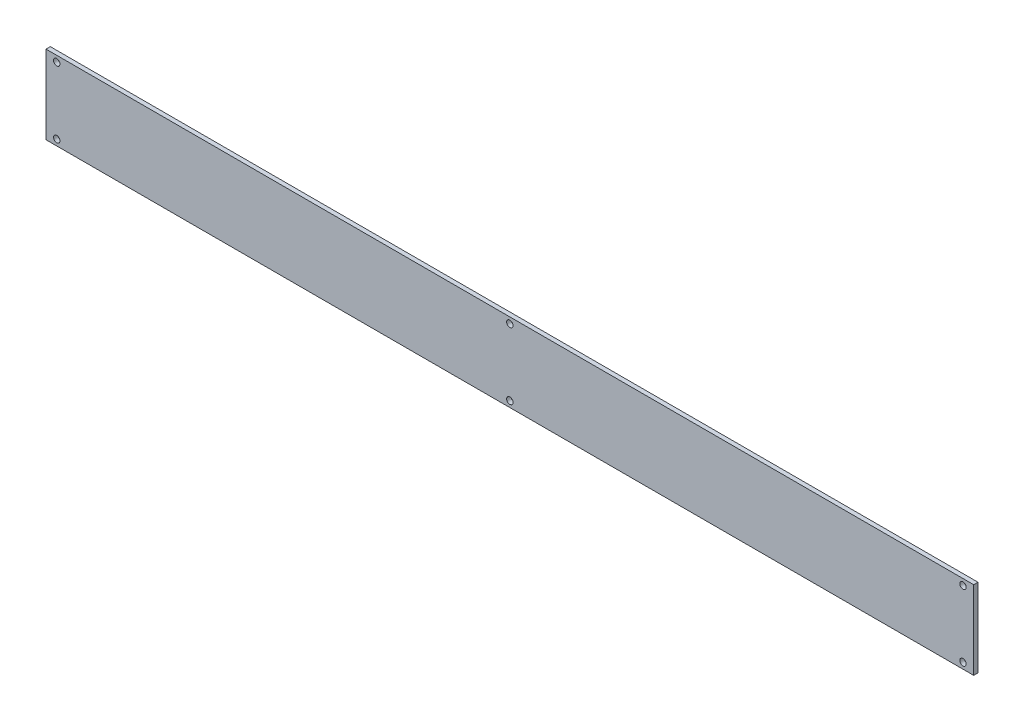
ISO-10303-21;
HEADER;
FILE_DESCRIPTION(('STEP AP214'),'2;1');
FILE_NAME('part.step','',(''),(''),'','','');
FILE_SCHEMA(('AUTOMOTIVE_DESIGN { 1 0 10303 214 1 1 1 1 }'));
ENDSEC;
DATA;
#1=APPLICATION_CONTEXT('core data for automotive mechanical design processes');
#2=APPLICATION_PROTOCOL_DEFINITION('international standard','automotive_design',2000,#1);
#3=PRODUCT_CONTEXT('',#1,'mechanical');
#4=PRODUCT('Part','Part','',(#3));
#5=PRODUCT_RELATED_PRODUCT_CATEGORY('part','',(#4));
#6=PRODUCT_DEFINITION_FORMATION('','',#4);
#7=PRODUCT_DEFINITION_CONTEXT('part definition',#1,'design');
#8=PRODUCT_DEFINITION('design','',#6,#7);
#9=PRODUCT_DEFINITION_SHAPE('','',#8);
#10=(LENGTH_UNIT() NAMED_UNIT(*) SI_UNIT(.MILLI.,.METRE.));
#11=(NAMED_UNIT(*) PLANE_ANGLE_UNIT() SI_UNIT($,.RADIAN.));
#12=(NAMED_UNIT(*) SI_UNIT($,.STERADIAN.) SOLID_ANGLE_UNIT());
#13=UNCERTAINTY_MEASURE_WITH_UNIT(LENGTH_MEASURE(1.E-05),#10,'distance_accuracy_value','');
#14=(GEOMETRIC_REPRESENTATION_CONTEXT(3) GLOBAL_UNCERTAINTY_ASSIGNED_CONTEXT((#13)) GLOBAL_UNIT_ASSIGNED_CONTEXT((#10,
#11,#12)) REPRESENTATION_CONTEXT('',''));
#15=CARTESIAN_POINT('',(0.,0.,0.));
#16=DIRECTION('',(0.,0.,1.));
#17=DIRECTION('',(1.,0.,0.));
#18=AXIS2_PLACEMENT_3D('',#15,#16,#17);
#19=CARTESIAN_POINT('',(-8.63113801452788,0.,1.));
#20=DIRECTION('',(1.,0.,0.));
#21=DIRECTION('',(0.,1.,0.));
#22=AXIS2_PLACEMENT_3D('',#19,#20,#21);
#23=PLANE('',#22);
#24=DIRECTION('',(0.,-1.,0.));
#25=VECTOR('',#24,1.);
#26=CARTESIAN_POINT('',(-8.63113801452788,0.,0.));
#27=LINE('',#26,#25);
#28=CARTESIAN_POINT('',(-8.63113801452789,18.0469249394673,0.));
#29=VERTEX_POINT('',#28);
#30=CARTESIAN_POINT('',(-8.63113801452788,-0.243075060532671,0.));
#31=VERTEX_POINT('',#30);
#32=EDGE_CURVE('E115',#29,#31,#27,.T.);
#33=ORIENTED_EDGE('',*,*,#32,.F.);
#34=DIRECTION('',(0.,0.,-1.));
#35=VECTOR('',#34,1.);
#36=CARTESIAN_POINT('',(-8.63113801452789,18.0469249394673,1.));
#37=LINE('',#36,#35);
#38=CARTESIAN_POINT('',(-8.63113801452789,18.0469249394673,1.));
#39=VERTEX_POINT('',#38);
#40=EDGE_CURVE('E11',#39,#29,#37,.T.);
#41=ORIENTED_EDGE('',*,*,#40,.F.);
#42=DIRECTION('',(0.,-1.,0.));
#43=VECTOR('',#42,1.);
#44=CARTESIAN_POINT('',(-8.63113801452788,0.,1.));
#45=LINE('',#44,#43);
#46=CARTESIAN_POINT('',(-8.63113801452788,-0.243075060532671,1.));
#47=VERTEX_POINT('',#46);
#48=EDGE_CURVE('E91',#39,#47,#45,.T.);
#49=ORIENTED_EDGE('',*,*,#48,.T.);
#50=DIRECTION('',(0.,0.,-1.));
#51=VECTOR('',#50,1.);
#52=CARTESIAN_POINT('',(-8.63113801452788,-0.243075060532671,1.));
#53=LINE('',#52,#51);
#54=EDGE_CURVE('E71',#47,#31,#53,.T.);
#55=ORIENTED_EDGE('',*,*,#54,.T.);
#56=EDGE_LOOP('',(#33,#41,#49,#55));
#57=FACE_BOUND('',#56,.T.);
#58=ADVANCED_FACE('F33',(#57),#23,.T.);
#59=CARTESIAN_POINT('',(0.,18.0469249394673,1.));
#60=DIRECTION('',(0.,1.,0.));
#61=DIRECTION('',(0.,0.,1.));
#62=AXIS2_PLACEMENT_3D('',#59,#60,#61);
#63=PLANE('',#62);
#64=DIRECTION('',(1.,0.,0.));
#65=VECTOR('',#64,1.);
#66=CARTESIAN_POINT('',(0.,18.0469249394673,0.));
#67=LINE('',#66,#65);
#68=CARTESIAN_POINT('',(-224.671138014528,18.0469249394673,0.));
#69=VERTEX_POINT('',#68);
#70=EDGE_CURVE('E84',#69,#29,#67,.T.);
#71=ORIENTED_EDGE('',*,*,#70,.F.);
#72=DIRECTION('',(0.,0.,-1.));
#73=VECTOR('',#72,1.);
#74=CARTESIAN_POINT('',(-224.671138014528,18.0469249394673,1.));
#75=LINE('',#74,#73);
#76=CARTESIAN_POINT('',(-224.671138014528,18.0469249394673,1.));
#77=VERTEX_POINT('',#76);
#78=EDGE_CURVE('E41',#77,#69,#75,.T.);
#79=ORIENTED_EDGE('',*,*,#78,.F.);
#80=DIRECTION('',(1.,0.,0.));
#81=VECTOR('',#80,1.);
#82=CARTESIAN_POINT('',(0.,18.0469249394673,1.));
#83=LINE('',#82,#81);
#84=EDGE_CURVE('E82',#77,#39,#83,.T.);
#85=ORIENTED_EDGE('',*,*,#84,.T.);
#86=ORIENTED_EDGE('',*,*,#40,.T.);
#87=EDGE_LOOP('',(#71,#79,#85,#86));
#88=FACE_BOUND('',#87,.T.);
#89=ADVANCED_FACE('F80',(#88),#63,.T.);
#90=CARTESIAN_POINT('',(-224.671138014528,0.,1.));
#91=DIRECTION('',(1.,0.,0.));
#92=DIRECTION('',(0.,0.,-1.));
#93=AXIS2_PLACEMENT_3D('',#90,#91,#92);
#94=PLANE('',#93);
#95=DIRECTION('',(0.,-1.,0.));
#96=VECTOR('',#95,1.);
#97=CARTESIAN_POINT('',(-224.671138014528,0.,0.));
#98=LINE('',#97,#96);
#99=CARTESIAN_POINT('',(-224.671138014528,-0.243075060532671,0.));
#100=VERTEX_POINT('',#99);
#101=EDGE_CURVE('E64',#69,#100,#98,.T.);
#102=ORIENTED_EDGE('',*,*,#101,.T.);
#103=DIRECTION('',(0.,0.,-1.));
#104=VECTOR('',#103,1.);
#105=CARTESIAN_POINT('',(-224.671138014528,-0.243075060532671,1.));
#106=LINE('',#105,#104);
#107=CARTESIAN_POINT('',(-224.671138014528,-0.243075060532671,1.));
#108=VERTEX_POINT('',#107);
#109=EDGE_CURVE('E85',#108,#100,#106,.T.);
#110=ORIENTED_EDGE('',*,*,#109,.F.);
#111=DIRECTION('',(0.,-1.,0.));
#112=VECTOR('',#111,1.);
#113=CARTESIAN_POINT('',(-224.671138014528,0.,1.));
#114=LINE('',#113,#112);
#115=EDGE_CURVE('E86',#77,#108,#114,.T.);
#116=ORIENTED_EDGE('',*,*,#115,.F.);
#117=ORIENTED_EDGE('',*,*,#78,.T.);
#118=EDGE_LOOP('',(#102,#110,#116,#117));
#119=FACE_BOUND('',#118,.T.);
#120=ADVANCED_FACE('F87',(#119),#94,.F.);
#121=CARTESIAN_POINT('',(-11.1311380145279,1.15192493946733,1.));
#122=DIRECTION('',(0.,0.,-1.));
#123=DIRECTION('',(-1.,0.,0.));
#124=AXIS2_PLACEMENT_3D('',#121,#122,#123);
#125=CYLINDRICAL_SURFACE('',#124,0.75);
#126=CARTESIAN_POINT('',(-11.1311380145279,1.15192493946733,1.));
#127=DIRECTION('',(0.,0.,1.));
#128=DIRECTION('',(1.,0.,0.));
#129=AXIS2_PLACEMENT_3D('',#126,#127,#128);
#130=CIRCLE('',#129,0.75);
#131=CARTESIAN_POINT('',(-10.3811380145279,1.15192493946733,1.));
#132=VERTEX_POINT('',#131);
#133=EDGE_CURVE('E109',#132,#132,#130,.F.);
#134=ORIENTED_EDGE('',*,*,#133,.F.);
#135=EDGE_LOOP('',(#134));
#136=FACE_BOUND('',#135,.T.);
#137=CARTESIAN_POINT('',(-11.1311380145279,1.15192493946733,0.));
#138=DIRECTION('',(0.,0.,1.));
#139=DIRECTION('',(1.,0.,0.));
#140=AXIS2_PLACEMENT_3D('',#137,#138,#139);
#141=CIRCLE('',#140,0.75);
#142=CARTESIAN_POINT('',(-10.3811380145279,1.15192493946733,0.));
#143=VERTEX_POINT('',#142);
#144=EDGE_CURVE('E134',#143,#143,#141,.F.);
#145=ORIENTED_EDGE('',*,*,#144,.T.);
#146=EDGE_LOOP('',(#145));
#147=FACE_BOUND('',#146,.T.);
#148=ADVANCED_FACE('F153',(#136,#147),#125,.F.);
#149=CARTESIAN_POINT('',(-116.651138014528,1.15192493946733,1.));
#150=DIRECTION('',(0.,0.,-1.));
#151=DIRECTION('',(-1.,0.,0.));
#152=AXIS2_PLACEMENT_3D('',#149,#150,#151);
#153=CYLINDRICAL_SURFACE('',#152,0.749999999999999);
#154=CARTESIAN_POINT('',(-116.651138014528,1.15192493946733,1.));
#155=DIRECTION('',(0.,0.,1.));
#156=DIRECTION('',(1.,0.,0.));
#157=AXIS2_PLACEMENT_3D('',#154,#155,#156);
#158=CIRCLE('',#157,0.749999999999999);
#159=CARTESIAN_POINT('',(-115.901138014528,1.15192493946733,1.));
#160=VERTEX_POINT('',#159);
#161=EDGE_CURVE('E106',#160,#160,#158,.F.);
#162=ORIENTED_EDGE('',*,*,#161,.F.);
#163=EDGE_LOOP('',(#162));
#164=FACE_BOUND('',#163,.T.);
#165=CARTESIAN_POINT('',(-116.651138014528,1.15192493946733,0.));
#166=DIRECTION('',(0.,0.,1.));
#167=DIRECTION('',(1.,0.,0.));
#168=AXIS2_PLACEMENT_3D('',#165,#166,#167);
#169=CIRCLE('',#168,0.749999999999999);
#170=CARTESIAN_POINT('',(-115.901138014528,1.15192493946733,0.));
#171=VERTEX_POINT('',#170);
#172=EDGE_CURVE('E131',#171,#171,#169,.F.);
#173=ORIENTED_EDGE('',*,*,#172,.T.);
#174=EDGE_LOOP('',(#173));
#175=FACE_BOUND('',#174,.T.);
#176=ADVANCED_FACE('F170',(#164,#175),#153,.F.);
#177=CARTESIAN_POINT('',(-222.171138014528,16.6519249394673,1.));
#178=DIRECTION('',(0.,0.,-1.));
#179=DIRECTION('',(-1.,0.,0.));
#180=AXIS2_PLACEMENT_3D('',#177,#178,#179);
#181=CYLINDRICAL_SURFACE('',#180,0.750000000000012);
#182=CARTESIAN_POINT('',(-222.171138014528,16.6519249394673,1.));
#183=DIRECTION('',(0.,0.,1.));
#184=DIRECTION('',(1.,0.,0.));
#185=AXIS2_PLACEMENT_3D('',#182,#183,#184);
#186=CIRCLE('',#185,0.750000000000012);
#187=CARTESIAN_POINT('',(-221.421138014528,16.6519249394673,1.));
#188=VERTEX_POINT('',#187);
#189=EDGE_CURVE('E103',#188,#188,#186,.T.);
#190=ORIENTED_EDGE('',*,*,#189,.T.);
#191=EDGE_LOOP('',(#190));
#192=FACE_BOUND('',#191,.T.);
#193=CARTESIAN_POINT('',(-222.171138014528,16.6519249394673,0.));
#194=DIRECTION('',(0.,0.,1.));
#195=DIRECTION('',(1.,0.,0.));
#196=AXIS2_PLACEMENT_3D('',#193,#194,#195);
#197=CIRCLE('',#196,0.750000000000012);
#198=CARTESIAN_POINT('',(-221.421138014528,16.6519249394673,0.));
#199=VERTEX_POINT('',#198);
#200=EDGE_CURVE('E128',#199,#199,#197,.T.);
#201=ORIENTED_EDGE('',*,*,#200,.F.);
#202=EDGE_LOOP('',(#201));
#203=FACE_BOUND('',#202,.T.);
#204=ADVANCED_FACE('F166',(#192,#203),#181,.F.);
#205=CARTESIAN_POINT('',(-116.651138014528,16.6519249394673,1.));
#206=DIRECTION('',(0.,0.,-1.));
#207=DIRECTION('',(-1.,0.,0.));
#208=AXIS2_PLACEMENT_3D('',#205,#206,#207);
#209=CYLINDRICAL_SURFACE('',#208,0.749999999999999);
#210=CARTESIAN_POINT('',(-116.651138014528,16.6519249394673,1.));
#211=DIRECTION('',(0.,0.,1.));
#212=DIRECTION('',(1.,0.,0.));
#213=AXIS2_PLACEMENT_3D('',#210,#211,#212);
#214=CIRCLE('',#213,0.749999999999999);
#215=CARTESIAN_POINT('',(-115.901138014528,16.6519249394673,1.));
#216=VERTEX_POINT('',#215);
#217=EDGE_CURVE('E100',#216,#216,#214,.T.);
#218=ORIENTED_EDGE('',*,*,#217,.T.);
#219=EDGE_LOOP('',(#218));
#220=FACE_BOUND('',#219,.T.);
#221=CARTESIAN_POINT('',(-116.651138014528,16.6519249394673,0.));
#222=DIRECTION('',(0.,0.,1.));
#223=DIRECTION('',(1.,0.,0.));
#224=AXIS2_PLACEMENT_3D('',#221,#222,#223);
#225=CIRCLE('',#224,0.749999999999999);
#226=CARTESIAN_POINT('',(-115.901138014528,16.6519249394673,0.));
#227=VERTEX_POINT('',#226);
#228=EDGE_CURVE('E125',#227,#227,#225,.T.);
#229=ORIENTED_EDGE('',*,*,#228,.F.);
#230=EDGE_LOOP('',(#229));
#231=FACE_BOUND('',#230,.T.);
#232=ADVANCED_FACE('F162',(#220,#231),#209,.F.);
#233=CARTESIAN_POINT('',(-11.1311380145279,16.6519249394673,1.));
#234=DIRECTION('',(0.,0.,-1.));
#235=DIRECTION('',(-1.,0.,0.));
#236=AXIS2_PLACEMENT_3D('',#233,#234,#235);
#237=CYLINDRICAL_SURFACE('',#236,0.75);
#238=CARTESIAN_POINT('',(-11.1311380145279,16.6519249394673,1.));
#239=DIRECTION('',(0.,0.,1.));
#240=DIRECTION('',(1.,0.,0.));
#241=AXIS2_PLACEMENT_3D('',#238,#239,#240);
#242=CIRCLE('',#241,0.75);
#243=CARTESIAN_POINT('',(-10.3811380145279,16.6519249394673,1.));
#244=VERTEX_POINT('',#243);
#245=EDGE_CURVE('E97',#244,#244,#242,.T.);
#246=ORIENTED_EDGE('',*,*,#245,.T.);
#247=EDGE_LOOP('',(#246));
#248=FACE_BOUND('',#247,.T.);
#249=CARTESIAN_POINT('',(-11.1311380145279,16.6519249394673,0.));
#250=DIRECTION('',(0.,0.,1.));
#251=DIRECTION('',(1.,0.,0.));
#252=AXIS2_PLACEMENT_3D('',#249,#250,#251);
#253=CIRCLE('',#252,0.75);
#254=CARTESIAN_POINT('',(-10.3811380145279,16.6519249394673,0.));
#255=VERTEX_POINT('',#254);
#256=EDGE_CURVE('E122',#255,#255,#253,.T.);
#257=ORIENTED_EDGE('',*,*,#256,.F.);
#258=EDGE_LOOP('',(#257));
#259=FACE_BOUND('',#258,.T.);
#260=ADVANCED_FACE('F159',(#248,#259),#237,.F.);
#261=CARTESIAN_POINT('',(0.,-0.243075060532671,1.));
#262=DIRECTION('',(0.,1.,0.));
#263=DIRECTION('',(0.,0.,1.));
#264=AXIS2_PLACEMENT_3D('',#261,#262,#263);
#265=PLANE('',#264);
#266=DIRECTION('',(1.,0.,0.));
#267=VECTOR('',#266,1.);
#268=CARTESIAN_POINT('',(0.,-0.243075060532671,0.));
#269=LINE('',#268,#267);
#270=EDGE_CURVE('E120',#100,#31,#269,.T.);
#271=ORIENTED_EDGE('',*,*,#270,.T.);
#272=ORIENTED_EDGE('',*,*,#54,.F.);
#273=DIRECTION('',(1.,0.,0.));
#274=VECTOR('',#273,1.);
#275=CARTESIAN_POINT('',(0.,-0.243075060532671,1.));
#276=LINE('',#275,#274);
#277=EDGE_CURVE('E49',#108,#47,#276,.T.);
#278=ORIENTED_EDGE('',*,*,#277,.F.);
#279=ORIENTED_EDGE('',*,*,#109,.T.);
#280=EDGE_LOOP('',(#271,#272,#278,#279));
#281=FACE_BOUND('',#280,.T.);
#282=ADVANCED_FACE('F142',(#281),#265,.F.);
#283=CARTESIAN_POINT('',(-222.171138014528,1.15192493946733,1.));
#284=DIRECTION('',(0.,0.,-1.));
#285=DIRECTION('',(-1.,0.,0.));
#286=AXIS2_PLACEMENT_3D('',#283,#284,#285);
#287=CYLINDRICAL_SURFACE('',#286,0.750000000000012);
#288=CARTESIAN_POINT('',(-222.171138014528,1.15192493946733,1.));
#289=DIRECTION('',(0.,0.,1.));
#290=DIRECTION('',(1.,0.,0.));
#291=AXIS2_PLACEMENT_3D('',#288,#289,#290);
#292=CIRCLE('',#291,0.750000000000012);
#293=CARTESIAN_POINT('',(-221.421138014528,1.15192493946733,1.));
#294=VERTEX_POINT('',#293);
#295=EDGE_CURVE('E112',#294,#294,#292,.F.);
#296=ORIENTED_EDGE('',*,*,#295,.F.);
#297=EDGE_LOOP('',(#296));
#298=FACE_BOUND('',#297,.T.);
#299=CARTESIAN_POINT('',(-222.171138014528,1.15192493946733,0.));
#300=DIRECTION('',(0.,0.,1.));
#301=DIRECTION('',(1.,0.,0.));
#302=AXIS2_PLACEMENT_3D('',#299,#300,#301);
#303=CIRCLE('',#302,0.750000000000012);
#304=CARTESIAN_POINT('',(-221.421138014528,1.15192493946733,0.));
#305=VERTEX_POINT('',#304);
#306=EDGE_CURVE('E93',#305,#305,#303,.F.);
#307=ORIENTED_EDGE('',*,*,#306,.T.);
#308=EDGE_LOOP('',(#307));
#309=FACE_BOUND('',#308,.T.);
#310=ADVANCED_FACE('F158',(#298,#309),#287,.F.);
#311=CARTESIAN_POINT('',(0.,0.,1.));
#312=DIRECTION('',(0.,0.,1.));
#313=DIRECTION('',(1.,0.,0.));
#314=AXIS2_PLACEMENT_3D('',#311,#312,#313);
#315=PLANE('',#314);
#316=ORIENTED_EDGE('',*,*,#48,.F.);
#317=ORIENTED_EDGE('',*,*,#84,.F.);
#318=ORIENTED_EDGE('',*,*,#115,.T.);
#319=ORIENTED_EDGE('',*,*,#277,.T.);
#320=EDGE_LOOP('',(#316,#317,#318,#319));
#321=FACE_BOUND('',#320,.T.);
#322=ORIENTED_EDGE('',*,*,#245,.F.);
#323=EDGE_LOOP('',(#322));
#324=FACE_BOUND('',#323,.T.);
#325=ORIENTED_EDGE('',*,*,#217,.F.);
#326=EDGE_LOOP('',(#325));
#327=FACE_BOUND('',#326,.T.);
#328=ORIENTED_EDGE('',*,*,#189,.F.);
#329=EDGE_LOOP('',(#328));
#330=FACE_BOUND('',#329,.T.);
#331=ORIENTED_EDGE('',*,*,#161,.T.);
#332=EDGE_LOOP('',(#331));
#333=FACE_BOUND('',#332,.T.);
#334=ORIENTED_EDGE('',*,*,#133,.T.);
#335=EDGE_LOOP('',(#334));
#336=FACE_BOUND('',#335,.T.);
#337=ORIENTED_EDGE('',*,*,#295,.T.);
#338=EDGE_LOOP('',(#337));
#339=FACE_BOUND('',#338,.T.);
#340=ADVANCED_FACE('F89',(#321,#324,#327,#330,#333,#336,#339),#315,.T.);
#341=CARTESIAN_POINT('',(0.,0.,0.));
#342=DIRECTION('',(0.,0.,1.));
#343=DIRECTION('',(1.,0.,0.));
#344=AXIS2_PLACEMENT_3D('',#341,#342,#343);
#345=PLANE('',#344);
#346=ORIENTED_EDGE('',*,*,#32,.T.);
#347=ORIENTED_EDGE('',*,*,#270,.F.);
#348=ORIENTED_EDGE('',*,*,#101,.F.);
#349=ORIENTED_EDGE('',*,*,#70,.T.);
#350=EDGE_LOOP('',(#346,#347,#348,#349));
#351=FACE_BOUND('',#350,.T.);
#352=ORIENTED_EDGE('',*,*,#256,.T.);
#353=EDGE_LOOP('',(#352));
#354=FACE_BOUND('',#353,.T.);
#355=ORIENTED_EDGE('',*,*,#228,.T.);
#356=EDGE_LOOP('',(#355));
#357=FACE_BOUND('',#356,.T.);
#358=ORIENTED_EDGE('',*,*,#200,.T.);
#359=EDGE_LOOP('',(#358));
#360=FACE_BOUND('',#359,.T.);
#361=ORIENTED_EDGE('',*,*,#172,.F.);
#362=EDGE_LOOP('',(#361));
#363=FACE_BOUND('',#362,.T.);
#364=ORIENTED_EDGE('',*,*,#144,.F.);
#365=EDGE_LOOP('',(#364));
#366=FACE_BOUND('',#365,.T.);
#367=ORIENTED_EDGE('',*,*,#306,.F.);
#368=EDGE_LOOP('',(#367));
#369=FACE_BOUND('',#368,.T.);
#370=ADVANCED_FACE('F144',(#351,#354,#357,#360,#363,#366,#369),#345,.F.);
#371=CLOSED_SHELL('',(#58,#89,#120,#148,#176,#204,#232,#260,#282,#310,#340,#370));
#372=MANIFOLD_SOLID_BREP('B2',#371);
#373=ADVANCED_BREP_SHAPE_REPRESENTATION('',(#18,#372),#14);
#374=SHAPE_DEFINITION_REPRESENTATION(#9,#373);
ENDSEC;
END-ISO-10303-21;
